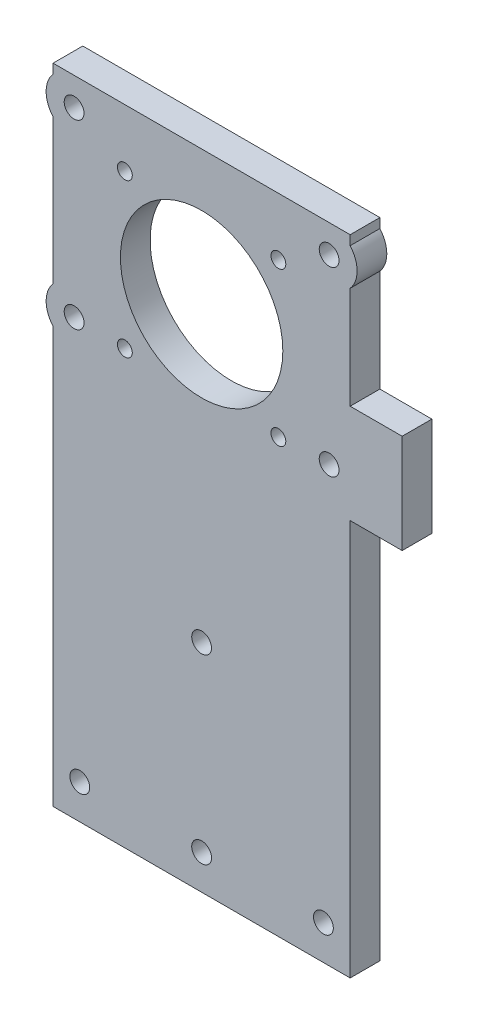
ISO-10303-21;
HEADER;
FILE_DESCRIPTION(('STEP AP214'),'2;1');
FILE_NAME('part.step','',(''),(''),'','','');
FILE_SCHEMA(('AUTOMOTIVE_DESIGN { 1 0 10303 214 1 1 1 1 }'));
ENDSEC;
DATA;
#1=APPLICATION_CONTEXT('core data for automotive mechanical design processes');
#2=APPLICATION_PROTOCOL_DEFINITION('international standard','automotive_design',2000,#1);
#3=PRODUCT_CONTEXT('',#1,'mechanical');
#4=PRODUCT('Part','Part','',(#3));
#5=PRODUCT_RELATED_PRODUCT_CATEGORY('part','',(#4));
#6=PRODUCT_DEFINITION_FORMATION('','',#4);
#7=PRODUCT_DEFINITION_CONTEXT('part definition',#1,'design');
#8=PRODUCT_DEFINITION('design','',#6,#7);
#9=PRODUCT_DEFINITION_SHAPE('','',#8);
#10=(LENGTH_UNIT() NAMED_UNIT(*) SI_UNIT(.MILLI.,.METRE.));
#11=(NAMED_UNIT(*) PLANE_ANGLE_UNIT() SI_UNIT($,.RADIAN.));
#12=(NAMED_UNIT(*) SI_UNIT($,.STERADIAN.) SOLID_ANGLE_UNIT());
#13=UNCERTAINTY_MEASURE_WITH_UNIT(LENGTH_MEASURE(1.E-05),#10,'distance_accuracy_value','');
#14=(GEOMETRIC_REPRESENTATION_CONTEXT(3) GLOBAL_UNCERTAINTY_ASSIGNED_CONTEXT((#13)) GLOBAL_UNIT_ASSIGNED_CONTEXT((#10,
#11,#12)) REPRESENTATION_CONTEXT('',''));
#15=CARTESIAN_POINT('',(0.,0.,0.));
#16=DIRECTION('',(0.,0.,1.));
#17=DIRECTION('',(1.,0.,0.));
#18=AXIS2_PLACEMENT_3D('',#15,#16,#17);
#19=CARTESIAN_POINT('',(30.,-62.,6.));
#20=DIRECTION('',(-1.,0.,0.));
#21=DIRECTION('',(0.,0.,1.));
#22=AXIS2_PLACEMENT_3D('',#19,#20,#21);
#23=PLANE('',#22);
#24=DIRECTION('',(0.,1.,0.));
#25=VECTOR('',#24,1.);
#26=CARTESIAN_POINT('',(30.,-62.,0.));
#27=LINE('',#26,#25);
#28=CARTESIAN_POINT('',(30.,-62.,0.));
#29=VERTEX_POINT('',#28);
#30=CARTESIAN_POINT('',(30.,18.,0.));
#31=VERTEX_POINT('',#30);
#32=EDGE_CURVE('E313',#29,#31,#27,.T.);
#33=ORIENTED_EDGE('',*,*,#32,.T.);
#34=DIRECTION('',(0.,0.,-1.));
#35=VECTOR('',#34,1.);
#36=CARTESIAN_POINT('',(30.,18.,28.588713996153));
#37=LINE('',#36,#35);
#38=CARTESIAN_POINT('',(30.,18.,6.));
#39=VERTEX_POINT('',#38);
#40=EDGE_CURVE('E56',#39,#31,#37,.T.);
#41=ORIENTED_EDGE('',*,*,#40,.F.);
#42=DIRECTION('',(0.,1.,0.));
#43=VECTOR('',#42,1.);
#44=CARTESIAN_POINT('',(30.,-62.,6.));
#45=LINE('',#44,#43);
#46=CARTESIAN_POINT('',(30.,-62.,6.));
#47=VERTEX_POINT('',#46);
#48=EDGE_CURVE('E304',#47,#39,#45,.T.);
#49=ORIENTED_EDGE('',*,*,#48,.F.);
#50=DIRECTION('',(0.,0.,-1.));
#51=VECTOR('',#50,1.);
#52=CARTESIAN_POINT('',(30.,-62.,6.));
#53=LINE('',#52,#51);
#54=EDGE_CURVE('E41',#47,#29,#53,.T.);
#55=ORIENTED_EDGE('',*,*,#54,.T.);
#56=EDGE_LOOP('',(#33,#41,#49,#55));
#57=FACE_BOUND('',#56,.T.);
#58=ADVANCED_FACE('F33',(#57),#23,.F.);
#59=CARTESIAN_POINT('',(-30.,-62.,6.));
#60=DIRECTION('',(1.,0.,0.));
#61=DIRECTION('',(0.,0.,-1.));
#62=AXIS2_PLACEMENT_3D('',#59,#60,#61);
#63=PLANE('',#62);
#64=DIRECTION('',(0.,-1.,0.));
#65=VECTOR('',#64,1.);
#66=CARTESIAN_POINT('',(-30.,-62.,6.));
#67=LINE('',#66,#65);
#68=CARTESIAN_POINT('',(-30.,21.9770979062027,6.));
#69=VERTEX_POINT('',#68);
#70=CARTESIAN_POINT('',(-30.,-62.,6.));
#71=VERTEX_POINT('',#70);
#72=EDGE_CURVE('E301',#69,#71,#67,.T.);
#73=ORIENTED_EDGE('',*,*,#72,.F.);
#74=DIRECTION('',(0.,0.,-1.));
#75=VECTOR('',#74,1.);
#76=CARTESIAN_POINT('',(-30.,21.9770979062027,28.588713996153));
#77=LINE('',#76,#75);
#78=CARTESIAN_POINT('',(-30.,21.9770979062027,0.));
#79=VERTEX_POINT('',#78);
#80=EDGE_CURVE('E183',#69,#79,#77,.T.);
#81=ORIENTED_EDGE('',*,*,#80,.T.);
#82=DIRECTION('',(0.,-1.,0.));
#83=VECTOR('',#82,1.);
#84=CARTESIAN_POINT('',(-30.,-62.,0.));
#85=LINE('',#84,#83);
#86=CARTESIAN_POINT('',(-30.,-62.,0.));
#87=VERTEX_POINT('',#86);
#88=EDGE_CURVE('E293',#79,#87,#85,.T.);
#89=ORIENTED_EDGE('',*,*,#88,.T.);
#90=DIRECTION('',(0.,0.,-1.));
#91=VECTOR('',#90,1.);
#92=CARTESIAN_POINT('',(-30.,-62.,6.));
#93=LINE('',#92,#91);
#94=EDGE_CURVE('E11',#71,#87,#93,.T.);
#95=ORIENTED_EDGE('',*,*,#94,.F.);
#96=EDGE_LOOP('',(#73,#81,#89,#95));
#97=FACE_BOUND('',#96,.T.);
#98=ADVANCED_FACE('F330',(#97),#63,.F.);
#99=CARTESIAN_POINT('',(-30.,58.6270979062027,0.));
#100=VERTEX_POINT('',#99);
#101=CARTESIAN_POINT('',(-30.,29.4229020937973,0.));
#102=VERTEX_POINT('',#101);
#103=EDGE_CURVE('E310',#100,#102,#85,.T.);
#104=ORIENTED_EDGE('',*,*,#103,.T.);
#105=DIRECTION('',(0.,0.,-1.));
#106=VECTOR('',#105,1.);
#107=CARTESIAN_POINT('',(-30.,29.4229020937973,28.588713996153));
#108=LINE('',#107,#106);
#109=CARTESIAN_POINT('',(-30.,29.4229020937973,6.));
#110=VERTEX_POINT('',#109);
#111=EDGE_CURVE('E179',#102,#110,#108,.F.);
#112=ORIENTED_EDGE('',*,*,#111,.T.);
#113=CARTESIAN_POINT('',(-30.,58.6270979062027,6.));
#114=VERTEX_POINT('',#113);
#115=EDGE_CURVE('E300',#114,#110,#67,.T.);
#116=ORIENTED_EDGE('',*,*,#115,.F.);
#117=DIRECTION('',(0.,0.,-1.));
#118=VECTOR('',#117,1.);
#119=CARTESIAN_POINT('',(-30.,58.6270979062027,28.588713996153));
#120=LINE('',#119,#118);
#121=EDGE_CURVE('E194',#114,#100,#120,.T.);
#122=ORIENTED_EDGE('',*,*,#121,.T.);
#123=EDGE_LOOP('',(#104,#112,#116,#122));
#124=FACE_BOUND('',#123,.T.);
#125=ADVANCED_FACE('F335',(#124),#63,.F.);
#126=CARTESIAN_POINT('',(30.,66.0729020937973,6.));
#127=VERTEX_POINT('',#126);
#128=CARTESIAN_POINT('',(30.,68.,6.));
#129=VERTEX_POINT('',#128);
#130=EDGE_CURVE('E303',#127,#129,#45,.T.);
#131=ORIENTED_EDGE('',*,*,#130,.F.);
#132=DIRECTION('',(0.,0.,-1.));
#133=VECTOR('',#132,1.);
#134=CARTESIAN_POINT('',(30.,66.0729020937973,28.588713996153));
#135=LINE('',#134,#133);
#136=CARTESIAN_POINT('',(30.,66.0729020937973,0.));
#137=VERTEX_POINT('',#136);
#138=EDGE_CURVE('E204',#127,#137,#135,.T.);
#139=ORIENTED_EDGE('',*,*,#138,.T.);
#140=CARTESIAN_POINT('',(30.,68.,0.));
#141=VERTEX_POINT('',#140);
#142=EDGE_CURVE('E312',#137,#141,#27,.T.);
#143=ORIENTED_EDGE('',*,*,#142,.T.);
#144=DIRECTION('',(0.,0.,-1.));
#145=VECTOR('',#144,1.);
#146=CARTESIAN_POINT('',(30.,68.,6.));
#147=LINE('',#146,#145);
#148=EDGE_CURVE('E235',#129,#141,#147,.T.);
#149=ORIENTED_EDGE('',*,*,#148,.F.);
#150=EDGE_LOOP('',(#131,#139,#143,#149));
#151=FACE_BOUND('',#150,.T.);
#152=ADVANCED_FACE('F354',(#151),#23,.F.);
#153=CARTESIAN_POINT('',(-30.,68.,0.));
#154=VERTEX_POINT('',#153);
#155=CARTESIAN_POINT('',(-30.,66.0729020937973,0.));
#156=VERTEX_POINT('',#155);
#157=EDGE_CURVE('E306',#154,#156,#85,.T.);
#158=ORIENTED_EDGE('',*,*,#157,.T.);
#159=DIRECTION('',(0.,0.,-1.));
#160=VECTOR('',#159,1.);
#161=CARTESIAN_POINT('',(-30.,66.0729020937973,28.588713996153));
#162=LINE('',#161,#160);
#163=CARTESIAN_POINT('',(-30.,66.0729020937973,6.));
#164=VERTEX_POINT('',#163);
#165=EDGE_CURVE('E190',#156,#164,#162,.F.);
#166=ORIENTED_EDGE('',*,*,#165,.T.);
#167=CARTESIAN_POINT('',(-30.,68.,6.));
#168=VERTEX_POINT('',#167);
#169=EDGE_CURVE('E296',#168,#164,#67,.T.);
#170=ORIENTED_EDGE('',*,*,#169,.F.);
#171=DIRECTION('',(0.,0.,1.));
#172=VECTOR('',#171,1.);
#173=CARTESIAN_POINT('',(-30.,68.,6.));
#174=LINE('',#173,#172);
#175=EDGE_CURVE('E242',#154,#168,#174,.T.);
#176=ORIENTED_EDGE('',*,*,#175,.F.);
#177=EDGE_LOOP('',(#158,#166,#170,#176));
#178=FACE_BOUND('',#177,.T.);
#179=ADVANCED_FACE('F35',(#178),#63,.F.);
#180=CARTESIAN_POINT('',(30.,-62.,6.));
#181=DIRECTION('',(0.,1.,0.));
#182=DIRECTION('',(-1.,0.,0.));
#183=AXIS2_PLACEMENT_3D('',#180,#181,#182);
#184=PLANE('',#183);
#185=DIRECTION('',(1.,0.,0.));
#186=VECTOR('',#185,1.);
#187=CARTESIAN_POINT('',(30.,-62.,0.));
#188=LINE('',#187,#186);
#189=EDGE_CURVE('E309',#87,#29,#188,.T.);
#190=ORIENTED_EDGE('',*,*,#189,.T.);
#191=ORIENTED_EDGE('',*,*,#54,.F.);
#192=DIRECTION('',(1.,0.,0.));
#193=VECTOR('',#192,1.);
#194=CARTESIAN_POINT('',(30.,-62.,6.));
#195=LINE('',#194,#193);
#196=EDGE_CURVE('E299',#71,#47,#195,.T.);
#197=ORIENTED_EDGE('',*,*,#196,.F.);
#198=ORIENTED_EDGE('',*,*,#94,.T.);
#199=EDGE_LOOP('',(#190,#191,#197,#198));
#200=FACE_BOUND('',#199,.T.);
#201=ADVANCED_FACE('F328',(#200),#184,.F.);
#202=CARTESIAN_POINT('',(30.,38.,6.));
#203=VERTEX_POINT('',#202);
#204=CARTESIAN_POINT('',(30.,58.6270979062027,6.));
#205=VERTEX_POINT('',#204);
#206=EDGE_CURVE('E48',#203,#205,#45,.T.);
#207=ORIENTED_EDGE('',*,*,#206,.F.);
#208=DIRECTION('',(0.,0.,-1.));
#209=VECTOR('',#208,1.);
#210=CARTESIAN_POINT('',(30.,38.,28.588713996153));
#211=LINE('',#210,#209);
#212=CARTESIAN_POINT('',(30.,38.,0.));
#213=VERTEX_POINT('',#212);
#214=EDGE_CURVE('E170',#203,#213,#211,.T.);
#215=ORIENTED_EDGE('',*,*,#214,.T.);
#216=CARTESIAN_POINT('',(30.,58.6270979062027,0.));
#217=VERTEX_POINT('',#216);
#218=EDGE_CURVE('E162',#213,#217,#27,.T.);
#219=ORIENTED_EDGE('',*,*,#218,.T.);
#220=DIRECTION('',(0.,0.,-1.));
#221=VECTOR('',#220,1.);
#222=CARTESIAN_POINT('',(30.,58.6270979062027,28.588713996153));
#223=LINE('',#222,#221);
#224=EDGE_CURVE('E200',#217,#205,#223,.F.);
#225=ORIENTED_EDGE('',*,*,#224,.T.);
#226=EDGE_LOOP('',(#207,#215,#219,#225));
#227=FACE_BOUND('',#226,.T.);
#228=ADVANCED_FACE('F357',(#227),#23,.F.);
#229=CARTESIAN_POINT('',(0.,0.,6.));
#230=DIRECTION('',(0.,0.,1.));
#231=DIRECTION('',(1.,0.,0.));
#232=AXIS2_PLACEMENT_3D('',#229,#230,#231);
#233=PLANE('',#232);
#234=ORIENTED_EDGE('',*,*,#115,.T.);
#235=CARTESIAN_POINT('',(-25.75,25.7,6.));
#236=DIRECTION('',(0.,0.,1.));
#237=DIRECTION('',(1.,0.,0.));
#238=AXIS2_PLACEMENT_3D('',#235,#236,#237);
#239=CIRCLE('',#238,5.65000000000003);
#240=EDGE_CURVE('E175',#69,#110,#239,.F.);
#241=ORIENTED_EDGE('',*,*,#240,.F.);
#242=ORIENTED_EDGE('',*,*,#72,.T.);
#243=ORIENTED_EDGE('',*,*,#196,.T.);
#244=ORIENTED_EDGE('',*,*,#48,.T.);
#245=DIRECTION('',(-1.,0.,0.));
#246=VECTOR('',#245,1.);
#247=CARTESIAN_POINT('',(40.5,18.,6.));
#248=LINE('',#247,#246);
#249=CARTESIAN_POINT('',(40.5,18.,6.));
#250=VERTEX_POINT('',#249);
#251=EDGE_CURVE('E163',#250,#39,#248,.T.);
#252=ORIENTED_EDGE('',*,*,#251,.F.);
#253=DIRECTION('',(0.,-1.,0.));
#254=VECTOR('',#253,1.);
#255=CARTESIAN_POINT('',(40.5,38.,6.));
#256=LINE('',#255,#254);
#257=CARTESIAN_POINT('',(40.5,38.,6.));
#258=VERTEX_POINT('',#257);
#259=EDGE_CURVE('E146',#258,#250,#256,.T.);
#260=ORIENTED_EDGE('',*,*,#259,.F.);
#261=DIRECTION('',(1.,0.,0.));
#262=VECTOR('',#261,1.);
#263=CARTESIAN_POINT('',(40.5,38.,6.));
#264=LINE('',#263,#262);
#265=EDGE_CURVE('E143',#203,#258,#264,.T.);
#266=ORIENTED_EDGE('',*,*,#265,.F.);
#267=ORIENTED_EDGE('',*,*,#206,.T.);
#268=CARTESIAN_POINT('',(25.75,62.35,6.));
#269=DIRECTION('',(0.,0.,1.));
#270=DIRECTION('',(1.,0.,0.));
#271=AXIS2_PLACEMENT_3D('',#268,#269,#270);
#272=CIRCLE('',#271,5.65000000000003);
#273=EDGE_CURVE('E197',#127,#205,#272,.F.);
#274=ORIENTED_EDGE('',*,*,#273,.F.);
#275=ORIENTED_EDGE('',*,*,#130,.T.);
#276=DIRECTION('',(1.,0.,0.));
#277=VECTOR('',#276,1.);
#278=CARTESIAN_POINT('',(30.,68.,6.));
#279=LINE('',#278,#277);
#280=EDGE_CURVE('E245',#168,#129,#279,.T.);
#281=ORIENTED_EDGE('',*,*,#280,.F.);
#282=ORIENTED_EDGE('',*,*,#169,.T.);
#283=CARTESIAN_POINT('',(-25.75,62.35,6.));
#284=DIRECTION('',(0.,0.,1.));
#285=DIRECTION('',(1.,0.,0.));
#286=AXIS2_PLACEMENT_3D('',#283,#284,#285);
#287=CIRCLE('',#286,5.65000000000003);
#288=EDGE_CURVE('E186',#114,#164,#287,.F.);
#289=ORIENTED_EDGE('',*,*,#288,.F.);
#290=EDGE_LOOP('',(#234,#241,#242,#243,#244,#252,#260,#266,#267,#274,#275,#281,#282,#289));
#291=FACE_BOUND('',#290,.T.);
#292=CARTESIAN_POINT('',(0.,-18.3,6.));
#293=DIRECTION('',(0.,0.,-1.));
#294=DIRECTION('',(-1.,0.,0.));
#295=AXIS2_PLACEMENT_3D('',#292,#293,#294);
#296=CIRCLE('',#295,2.);
#297=CARTESIAN_POINT('',(-2.00000000000001,-18.3,6.));
#298=VERTEX_POINT('',#297);
#299=EDGE_CURVE('E208',#298,#298,#296,.T.);
#300=ORIENTED_EDGE('',*,*,#299,.T.);
#301=EDGE_LOOP('',(#300));
#302=FACE_BOUND('',#301,.T.);
#303=CARTESIAN_POINT('',(25.75,25.7,6.));
#304=DIRECTION('',(0.,0.,-1.));
#305=DIRECTION('',(-1.,0.,0.));
#306=AXIS2_PLACEMENT_3D('',#303,#304,#305);
#307=CIRCLE('',#306,2.);
#308=CARTESIAN_POINT('',(23.75,25.7,6.));
#309=VERTEX_POINT('',#308);
#310=EDGE_CURVE('E214',#309,#309,#307,.T.);
#311=ORIENTED_EDGE('',*,*,#310,.T.);
#312=EDGE_LOOP('',(#311));
#313=FACE_BOUND('',#312,.T.);
#314=CARTESIAN_POINT('',(24.6,-55.,6.));
#315=DIRECTION('',(0.,0.,1.));
#316=DIRECTION('',(1.,0.,0.));
#317=AXIS2_PLACEMENT_3D('',#314,#315,#316);
#318=CIRCLE('',#317,2.);
#319=CARTESIAN_POINT('',(26.6,-55.,6.));
#320=VERTEX_POINT('',#319);
#321=EDGE_CURVE('E247',#320,#320,#318,.T.);
#322=ORIENTED_EDGE('',*,*,#321,.F.);
#323=EDGE_LOOP('',(#322));
#324=FACE_BOUND('',#323,.T.);
#325=CARTESIAN_POINT('',(0.,-55.,6.));
#326=DIRECTION('',(0.,0.,1.));
#327=DIRECTION('',(1.,0.,0.));
#328=AXIS2_PLACEMENT_3D('',#325,#326,#327);
#329=CIRCLE('',#328,2.);
#330=CARTESIAN_POINT('',(1.99999999999999,-55.,6.));
#331=VERTEX_POINT('',#330);
#332=EDGE_CURVE('E251',#331,#331,#329,.T.);
#333=ORIENTED_EDGE('',*,*,#332,.F.);
#334=EDGE_LOOP('',(#333));
#335=FACE_BOUND('',#334,.T.);
#336=CARTESIAN_POINT('',(-24.6,-55.,6.));
#337=DIRECTION('',(0.,0.,1.));
#338=DIRECTION('',(1.,0.,0.));
#339=AXIS2_PLACEMENT_3D('',#336,#337,#338);
#340=CIRCLE('',#339,2.);
#341=CARTESIAN_POINT('',(-22.6,-55.,6.));
#342=VERTEX_POINT('',#341);
#343=EDGE_CURVE('E257',#342,#342,#340,.T.);
#344=ORIENTED_EDGE('',*,*,#343,.F.);
#345=EDGE_LOOP('',(#344));
#346=FACE_BOUND('',#345,.T.);
#347=CARTESIAN_POINT('',(-15.5,25.35,6.));
#348=DIRECTION('',(0.,0.,1.));
#349=DIRECTION('',(1.,0.,0.));
#350=AXIS2_PLACEMENT_3D('',#347,#348,#349);
#351=CIRCLE('',#350,1.5);
#352=CARTESIAN_POINT('',(-14.,25.35,6.));
#353=VERTEX_POINT('',#352);
#354=EDGE_CURVE('E263',#353,#353,#351,.T.);
#355=ORIENTED_EDGE('',*,*,#354,.F.);
#356=EDGE_LOOP('',(#355));
#357=FACE_BOUND('',#356,.T.);
#358=CARTESIAN_POINT('',(15.5,25.35,6.));
#359=DIRECTION('',(0.,0.,1.));
#360=DIRECTION('',(1.,0.,0.));
#361=AXIS2_PLACEMENT_3D('',#358,#359,#360);
#362=CIRCLE('',#361,1.5);
#363=CARTESIAN_POINT('',(17.,25.35,6.));
#364=VERTEX_POINT('',#363);
#365=EDGE_CURVE('E269',#364,#364,#362,.T.);
#366=ORIENTED_EDGE('',*,*,#365,.F.);
#367=EDGE_LOOP('',(#366));
#368=FACE_BOUND('',#367,.T.);
#369=CARTESIAN_POINT('',(15.5,56.35,6.));
#370=DIRECTION('',(0.,0.,1.));
#371=DIRECTION('',(1.,0.,0.));
#372=AXIS2_PLACEMENT_3D('',#369,#370,#371);
#373=CIRCLE('',#372,1.5);
#374=CARTESIAN_POINT('',(17.,56.35,6.));
#375=VERTEX_POINT('',#374);
#376=EDGE_CURVE('E275',#375,#375,#373,.T.);
#377=ORIENTED_EDGE('',*,*,#376,.F.);
#378=EDGE_LOOP('',(#377));
#379=FACE_BOUND('',#378,.T.);
#380=CARTESIAN_POINT('',(-15.5,56.35,6.));
#381=DIRECTION('',(0.,0.,1.));
#382=DIRECTION('',(1.,0.,0.));
#383=AXIS2_PLACEMENT_3D('',#380,#381,#382);
#384=CIRCLE('',#383,1.5);
#385=CARTESIAN_POINT('',(-14.,56.35,6.));
#386=VERTEX_POINT('',#385);
#387=EDGE_CURVE('E281',#386,#386,#384,.T.);
#388=ORIENTED_EDGE('',*,*,#387,.F.);
#389=EDGE_LOOP('',(#388));
#390=FACE_BOUND('',#389,.T.);
#391=CARTESIAN_POINT('',(0.,40.85,6.));
#392=DIRECTION('',(0.,0.,1.));
#393=DIRECTION('',(1.,0.,0.));
#394=AXIS2_PLACEMENT_3D('',#391,#392,#393);
#395=CIRCLE('',#394,16.4);
#396=CARTESIAN_POINT('',(16.4,40.85,6.));
#397=VERTEX_POINT('',#396);
#398=EDGE_CURVE('E287',#397,#397,#395,.T.);
#399=ORIENTED_EDGE('',*,*,#398,.F.);
#400=EDGE_LOOP('',(#399));
#401=FACE_BOUND('',#400,.T.);
#402=CARTESIAN_POINT('',(25.75,62.35,6.));
#403=DIRECTION('',(0.,0.,-1.));
#404=DIRECTION('',(-1.,0.,0.));
#405=AXIS2_PLACEMENT_3D('',#402,#403,#404);
#406=CIRCLE('',#405,2.);
#407=CARTESIAN_POINT('',(23.75,62.35,6.));
#408=VERTEX_POINT('',#407);
#409=EDGE_CURVE('E232',#408,#408,#406,.T.);
#410=ORIENTED_EDGE('',*,*,#409,.T.);
#411=EDGE_LOOP('',(#410));
#412=FACE_BOUND('',#411,.T.);
#413=CARTESIAN_POINT('',(-25.75,62.35,6.));
#414=DIRECTION('',(0.,0.,-1.));
#415=DIRECTION('',(-1.,0.,0.));
#416=AXIS2_PLACEMENT_3D('',#413,#414,#415);
#417=CIRCLE('',#416,1.99999999999999);
#418=CARTESIAN_POINT('',(-27.75,62.35,6.));
#419=VERTEX_POINT('',#418);
#420=EDGE_CURVE('E226',#419,#419,#417,.T.);
#421=ORIENTED_EDGE('',*,*,#420,.T.);
#422=EDGE_LOOP('',(#421));
#423=FACE_BOUND('',#422,.T.);
#424=CARTESIAN_POINT('',(-25.75,25.7,6.));
#425=DIRECTION('',(0.,0.,-1.));
#426=DIRECTION('',(-1.,0.,0.));
#427=AXIS2_PLACEMENT_3D('',#424,#425,#426);
#428=CIRCLE('',#427,2.);
#429=CARTESIAN_POINT('',(-27.75,25.7,6.));
#430=VERTEX_POINT('',#429);
#431=EDGE_CURVE('E220',#430,#430,#428,.T.);
#432=ORIENTED_EDGE('',*,*,#431,.T.);
#433=EDGE_LOOP('',(#432));
#434=FACE_BOUND('',#433,.T.);
#435=ADVANCED_FACE('F324',(#291,#302,#313,#324,#335,#346,#357,#368,#379,#390,#401,#412,#423,
#434),#233,.T.);
#436=CARTESIAN_POINT('',(0.,0.,0.));
#437=DIRECTION('',(0.,0.,1.));
#438=DIRECTION('',(1.,0.,0.));
#439=AXIS2_PLACEMENT_3D('',#436,#437,#438);
#440=PLANE('',#439);
#441=CARTESIAN_POINT('',(0.,-18.3,0.));
#442=DIRECTION('',(0.,0.,-1.));
#443=DIRECTION('',(-1.,0.,0.));
#444=AXIS2_PLACEMENT_3D('',#441,#442,#443);
#445=CIRCLE('',#444,2.);
#446=CARTESIAN_POINT('',(-2.00000000000001,-18.3,0.));
#447=VERTEX_POINT('',#446);
#448=EDGE_CURVE('E207',#447,#447,#445,.T.);
#449=ORIENTED_EDGE('',*,*,#448,.F.);
#450=EDGE_LOOP('',(#449));
#451=FACE_BOUND('',#450,.T.);
#452=CARTESIAN_POINT('',(25.75,25.7,0.));
#453=DIRECTION('',(0.,0.,-1.));
#454=DIRECTION('',(-1.,0.,0.));
#455=AXIS2_PLACEMENT_3D('',#452,#453,#454);
#456=CIRCLE('',#455,2.);
#457=CARTESIAN_POINT('',(23.75,25.7,0.));
#458=VERTEX_POINT('',#457);
#459=EDGE_CURVE('E211',#458,#458,#456,.T.);
#460=ORIENTED_EDGE('',*,*,#459,.F.);
#461=EDGE_LOOP('',(#460));
#462=FACE_BOUND('',#461,.T.);
#463=CARTESIAN_POINT('',(24.6,-55.,0.));
#464=DIRECTION('',(0.,0.,1.));
#465=DIRECTION('',(1.,0.,0.));
#466=AXIS2_PLACEMENT_3D('',#463,#464,#465);
#467=CIRCLE('',#466,2.);
#468=CARTESIAN_POINT('',(26.6,-55.,0.));
#469=VERTEX_POINT('',#468);
#470=EDGE_CURVE('E248',#469,#469,#467,.T.);
#471=ORIENTED_EDGE('',*,*,#470,.T.);
#472=EDGE_LOOP('',(#471));
#473=FACE_BOUND('',#472,.T.);
#474=CARTESIAN_POINT('',(0.,-55.,0.));
#475=DIRECTION('',(0.,0.,1.));
#476=DIRECTION('',(1.,0.,0.));
#477=AXIS2_PLACEMENT_3D('',#474,#475,#476);
#478=CIRCLE('',#477,2.);
#479=CARTESIAN_POINT('',(1.99999999999999,-55.,0.));
#480=VERTEX_POINT('',#479);
#481=EDGE_CURVE('E254',#480,#480,#478,.T.);
#482=ORIENTED_EDGE('',*,*,#481,.T.);
#483=EDGE_LOOP('',(#482));
#484=FACE_BOUND('',#483,.T.);
#485=CARTESIAN_POINT('',(-24.6,-55.,0.));
#486=DIRECTION('',(0.,0.,1.));
#487=DIRECTION('',(1.,0.,0.));
#488=AXIS2_PLACEMENT_3D('',#485,#486,#487);
#489=CIRCLE('',#488,2.);
#490=CARTESIAN_POINT('',(-22.6,-55.,0.));
#491=VERTEX_POINT('',#490);
#492=EDGE_CURVE('E260',#491,#491,#489,.T.);
#493=ORIENTED_EDGE('',*,*,#492,.T.);
#494=EDGE_LOOP('',(#493));
#495=FACE_BOUND('',#494,.T.);
#496=CARTESIAN_POINT('',(-15.5,25.35,0.));
#497=DIRECTION('',(0.,0.,1.));
#498=DIRECTION('',(1.,0.,0.));
#499=AXIS2_PLACEMENT_3D('',#496,#497,#498);
#500=CIRCLE('',#499,1.5);
#501=CARTESIAN_POINT('',(-14.,25.35,0.));
#502=VERTEX_POINT('',#501);
#503=EDGE_CURVE('E266',#502,#502,#500,.T.);
#504=ORIENTED_EDGE('',*,*,#503,.T.);
#505=EDGE_LOOP('',(#504));
#506=FACE_BOUND('',#505,.T.);
#507=CARTESIAN_POINT('',(15.5,25.35,0.));
#508=DIRECTION('',(0.,0.,1.));
#509=DIRECTION('',(1.,0.,0.));
#510=AXIS2_PLACEMENT_3D('',#507,#508,#509);
#511=CIRCLE('',#510,1.5);
#512=CARTESIAN_POINT('',(17.,25.35,0.));
#513=VERTEX_POINT('',#512);
#514=EDGE_CURVE('E272',#513,#513,#511,.T.);
#515=ORIENTED_EDGE('',*,*,#514,.T.);
#516=EDGE_LOOP('',(#515));
#517=FACE_BOUND('',#516,.T.);
#518=CARTESIAN_POINT('',(15.5,56.35,0.));
#519=DIRECTION('',(0.,0.,1.));
#520=DIRECTION('',(1.,0.,0.));
#521=AXIS2_PLACEMENT_3D('',#518,#519,#520);
#522=CIRCLE('',#521,1.5);
#523=CARTESIAN_POINT('',(17.,56.35,0.));
#524=VERTEX_POINT('',#523);
#525=EDGE_CURVE('E278',#524,#524,#522,.T.);
#526=ORIENTED_EDGE('',*,*,#525,.T.);
#527=EDGE_LOOP('',(#526));
#528=FACE_BOUND('',#527,.T.);
#529=CARTESIAN_POINT('',(-15.5,56.35,0.));
#530=DIRECTION('',(0.,0.,1.));
#531=DIRECTION('',(1.,0.,0.));
#532=AXIS2_PLACEMENT_3D('',#529,#530,#531);
#533=CIRCLE('',#532,1.5);
#534=CARTESIAN_POINT('',(-14.,56.35,0.));
#535=VERTEX_POINT('',#534);
#536=EDGE_CURVE('E284',#535,#535,#533,.T.);
#537=ORIENTED_EDGE('',*,*,#536,.T.);
#538=EDGE_LOOP('',(#537));
#539=FACE_BOUND('',#538,.T.);
#540=CARTESIAN_POINT('',(0.,40.85,0.));
#541=DIRECTION('',(0.,0.,1.));
#542=DIRECTION('',(1.,0.,0.));
#543=AXIS2_PLACEMENT_3D('',#540,#541,#542);
#544=CIRCLE('',#543,16.4);
#545=CARTESIAN_POINT('',(16.4,40.85,0.));
#546=VERTEX_POINT('',#545);
#547=EDGE_CURVE('E290',#546,#546,#544,.T.);
#548=ORIENTED_EDGE('',*,*,#547,.T.);
#549=EDGE_LOOP('',(#548));
#550=FACE_BOUND('',#549,.T.);
#551=ORIENTED_EDGE('',*,*,#88,.F.);
#552=CARTESIAN_POINT('',(-25.75,25.7,0.));
#553=DIRECTION('',(0.,0.,-1.));
#554=DIRECTION('',(-1.,0.,0.));
#555=AXIS2_PLACEMENT_3D('',#552,#553,#554);
#556=CIRCLE('',#555,5.65000000000003);
#557=EDGE_CURVE('E176',#79,#102,#556,.T.);
#558=ORIENTED_EDGE('',*,*,#557,.T.);
#559=ORIENTED_EDGE('',*,*,#103,.F.);
#560=CARTESIAN_POINT('',(-25.75,62.35,0.));
#561=DIRECTION('',(0.,0.,-1.));
#562=DIRECTION('',(-1.,0.,0.));
#563=AXIS2_PLACEMENT_3D('',#560,#561,#562);
#564=CIRCLE('',#563,5.65000000000003);
#565=EDGE_CURVE('E187',#100,#156,#564,.T.);
#566=ORIENTED_EDGE('',*,*,#565,.T.);
#567=ORIENTED_EDGE('',*,*,#157,.F.);
#568=DIRECTION('',(-1.,0.,0.));
#569=VECTOR('',#568,1.);
#570=CARTESIAN_POINT('',(30.,68.,0.));
#571=LINE('',#570,#569);
#572=EDGE_CURVE('E240',#141,#154,#571,.T.);
#573=ORIENTED_EDGE('',*,*,#572,.F.);
#574=ORIENTED_EDGE('',*,*,#142,.F.);
#575=CARTESIAN_POINT('',(25.75,62.35,0.));
#576=DIRECTION('',(0.,0.,-1.));
#577=DIRECTION('',(-1.,0.,0.));
#578=AXIS2_PLACEMENT_3D('',#575,#576,#577);
#579=CIRCLE('',#578,5.65000000000003);
#580=EDGE_CURVE('E198',#137,#217,#579,.T.);
#581=ORIENTED_EDGE('',*,*,#580,.T.);
#582=ORIENTED_EDGE('',*,*,#218,.F.);
#583=DIRECTION('',(1.,0.,0.));
#584=VECTOR('',#583,1.);
#585=CARTESIAN_POINT('',(40.5,38.,0.));
#586=LINE('',#585,#584);
#587=CARTESIAN_POINT('',(40.5,38.,0.));
#588=VERTEX_POINT('',#587);
#589=EDGE_CURVE('E142',#213,#588,#586,.T.);
#590=ORIENTED_EDGE('',*,*,#589,.T.);
#591=DIRECTION('',(0.,-1.,0.));
#592=VECTOR('',#591,1.);
#593=CARTESIAN_POINT('',(40.5,38.,0.));
#594=LINE('',#593,#592);
#595=CARTESIAN_POINT('',(40.5,18.,0.));
#596=VERTEX_POINT('',#595);
#597=EDGE_CURVE('E149',#588,#596,#594,.T.);
#598=ORIENTED_EDGE('',*,*,#597,.T.);
#599=DIRECTION('',(-1.,0.,0.));
#600=VECTOR('',#599,1.);
#601=CARTESIAN_POINT('',(40.5,18.,0.));
#602=LINE('',#601,#600);
#603=EDGE_CURVE('E156',#596,#31,#602,.T.);
#604=ORIENTED_EDGE('',*,*,#603,.T.);
#605=ORIENTED_EDGE('',*,*,#32,.F.);
#606=ORIENTED_EDGE('',*,*,#189,.F.);
#607=EDGE_LOOP('',(#551,#558,#559,#566,#567,#573,#574,#581,#582,#590,#598,#604,#605,#606));
#608=FACE_BOUND('',#607,.T.);
#609=CARTESIAN_POINT('',(25.75,62.35,0.));
#610=DIRECTION('',(0.,0.,-1.));
#611=DIRECTION('',(-1.,0.,0.));
#612=AXIS2_PLACEMENT_3D('',#609,#610,#611);
#613=CIRCLE('',#612,2.);
#614=CARTESIAN_POINT('',(23.75,62.35,0.));
#615=VERTEX_POINT('',#614);
#616=EDGE_CURVE('E229',#615,#615,#613,.T.);
#617=ORIENTED_EDGE('',*,*,#616,.F.);
#618=EDGE_LOOP('',(#617));
#619=FACE_BOUND('',#618,.T.);
#620=CARTESIAN_POINT('',(-25.75,62.35,0.));
#621=DIRECTION('',(0.,0.,-1.));
#622=DIRECTION('',(-1.,0.,0.));
#623=AXIS2_PLACEMENT_3D('',#620,#621,#622);
#624=CIRCLE('',#623,1.99999999999999);
#625=CARTESIAN_POINT('',(-27.75,62.35,0.));
#626=VERTEX_POINT('',#625);
#627=EDGE_CURVE('E223',#626,#626,#624,.T.);
#628=ORIENTED_EDGE('',*,*,#627,.F.);
#629=EDGE_LOOP('',(#628));
#630=FACE_BOUND('',#629,.T.);
#631=CARTESIAN_POINT('',(-25.75,25.7,0.));
#632=DIRECTION('',(0.,0.,-1.));
#633=DIRECTION('',(-1.,0.,0.));
#634=AXIS2_PLACEMENT_3D('',#631,#632,#633);
#635=CIRCLE('',#634,2.);
#636=CARTESIAN_POINT('',(-27.75,25.7,0.));
#637=VERTEX_POINT('',#636);
#638=EDGE_CURVE('E217',#637,#637,#635,.T.);
#639=ORIENTED_EDGE('',*,*,#638,.F.);
#640=EDGE_LOOP('',(#639));
#641=FACE_BOUND('',#640,.T.);
#642=ADVANCED_FACE('F159',(#451,#462,#473,#484,#495,#506,#517,#528,#539,#550,#608,#619,#630,
#641),#440,.F.);
#643=CARTESIAN_POINT('',(0.,40.85,0.));
#644=DIRECTION('',(0.,0.,1.));
#645=DIRECTION('',(1.,0.,0.));
#646=AXIS2_PLACEMENT_3D('',#643,#644,#645);
#647=CYLINDRICAL_SURFACE('',#646,16.4);
#648=ORIENTED_EDGE('',*,*,#547,.F.);
#649=EDGE_LOOP('',(#648));
#650=FACE_BOUND('',#649,.T.);
#651=ORIENTED_EDGE('',*,*,#398,.T.);
#652=EDGE_LOOP('',(#651));
#653=FACE_BOUND('',#652,.T.);
#654=ADVANCED_FACE('F429',(#650,#653),#647,.F.);
#655=CARTESIAN_POINT('',(-15.5,56.35,0.));
#656=DIRECTION('',(0.,0.,1.));
#657=DIRECTION('',(1.,0.,0.));
#658=AXIS2_PLACEMENT_3D('',#655,#656,#657);
#659=CYLINDRICAL_SURFACE('',#658,1.5);
#660=ORIENTED_EDGE('',*,*,#536,.F.);
#661=EDGE_LOOP('',(#660));
#662=FACE_BOUND('',#661,.T.);
#663=ORIENTED_EDGE('',*,*,#387,.T.);
#664=EDGE_LOOP('',(#663));
#665=FACE_BOUND('',#664,.T.);
#666=ADVANCED_FACE('F576',(#662,#665),#659,.F.);
#667=CARTESIAN_POINT('',(15.5,56.35,0.));
#668=DIRECTION('',(0.,0.,1.));
#669=DIRECTION('',(1.,0.,0.));
#670=AXIS2_PLACEMENT_3D('',#667,#668,#669);
#671=CYLINDRICAL_SURFACE('',#670,1.5);
#672=ORIENTED_EDGE('',*,*,#525,.F.);
#673=EDGE_LOOP('',(#672));
#674=FACE_BOUND('',#673,.T.);
#675=ORIENTED_EDGE('',*,*,#376,.T.);
#676=EDGE_LOOP('',(#675));
#677=FACE_BOUND('',#676,.T.);
#678=ADVANCED_FACE('F585',(#674,#677),#671,.F.);
#679=CARTESIAN_POINT('',(15.5,25.35,0.));
#680=DIRECTION('',(0.,0.,1.));
#681=DIRECTION('',(1.,0.,0.));
#682=AXIS2_PLACEMENT_3D('',#679,#680,#681);
#683=CYLINDRICAL_SURFACE('',#682,1.5);
#684=ORIENTED_EDGE('',*,*,#514,.F.);
#685=EDGE_LOOP('',(#684));
#686=FACE_BOUND('',#685,.T.);
#687=ORIENTED_EDGE('',*,*,#365,.T.);
#688=EDGE_LOOP('',(#687));
#689=FACE_BOUND('',#688,.T.);
#690=ADVANCED_FACE('F594',(#686,#689),#683,.F.);
#691=CARTESIAN_POINT('',(-15.5,25.35,0.));
#692=DIRECTION('',(0.,0.,1.));
#693=DIRECTION('',(1.,0.,0.));
#694=AXIS2_PLACEMENT_3D('',#691,#692,#693);
#695=CYLINDRICAL_SURFACE('',#694,1.5);
#696=ORIENTED_EDGE('',*,*,#503,.F.);
#697=EDGE_LOOP('',(#696));
#698=FACE_BOUND('',#697,.T.);
#699=ORIENTED_EDGE('',*,*,#354,.T.);
#700=EDGE_LOOP('',(#699));
#701=FACE_BOUND('',#700,.T.);
#702=ADVANCED_FACE('F603',(#698,#701),#695,.F.);
#703=CARTESIAN_POINT('',(-24.6,-55.,0.));
#704=DIRECTION('',(0.,0.,1.));
#705=DIRECTION('',(1.,0.,0.));
#706=AXIS2_PLACEMENT_3D('',#703,#704,#705);
#707=CYLINDRICAL_SURFACE('',#706,2.);
#708=ORIENTED_EDGE('',*,*,#492,.F.);
#709=EDGE_LOOP('',(#708));
#710=FACE_BOUND('',#709,.T.);
#711=ORIENTED_EDGE('',*,*,#343,.T.);
#712=EDGE_LOOP('',(#711));
#713=FACE_BOUND('',#712,.T.);
#714=ADVANCED_FACE('F612',(#710,#713),#707,.F.);
#715=CARTESIAN_POINT('',(0.,-55.,0.));
#716=DIRECTION('',(0.,0.,1.));
#717=DIRECTION('',(1.,0.,0.));
#718=AXIS2_PLACEMENT_3D('',#715,#716,#717);
#719=CYLINDRICAL_SURFACE('',#718,2.);
#720=ORIENTED_EDGE('',*,*,#481,.F.);
#721=EDGE_LOOP('',(#720));
#722=FACE_BOUND('',#721,.T.);
#723=ORIENTED_EDGE('',*,*,#332,.T.);
#724=EDGE_LOOP('',(#723));
#725=FACE_BOUND('',#724,.T.);
#726=ADVANCED_FACE('F621',(#722,#725),#719,.F.);
#727=CARTESIAN_POINT('',(24.6,-55.,0.));
#728=DIRECTION('',(0.,0.,1.));
#729=DIRECTION('',(1.,0.,0.));
#730=AXIS2_PLACEMENT_3D('',#727,#728,#729);
#731=CYLINDRICAL_SURFACE('',#730,2.);
#732=ORIENTED_EDGE('',*,*,#470,.F.);
#733=EDGE_LOOP('',(#732));
#734=FACE_BOUND('',#733,.T.);
#735=ORIENTED_EDGE('',*,*,#321,.T.);
#736=EDGE_LOOP('',(#735));
#737=FACE_BOUND('',#736,.T.);
#738=ADVANCED_FACE('F441',(#734,#737),#731,.F.);
#739=CARTESIAN_POINT('',(0.,68.,0.));
#740=DIRECTION('',(0.,1.,0.));
#741=DIRECTION('',(0.,0.,1.));
#742=AXIS2_PLACEMENT_3D('',#739,#740,#741);
#743=PLANE('',#742);
#744=ORIENTED_EDGE('',*,*,#572,.T.);
#745=ORIENTED_EDGE('',*,*,#175,.T.);
#746=ORIENTED_EDGE('',*,*,#280,.T.);
#747=ORIENTED_EDGE('',*,*,#148,.T.);
#748=EDGE_LOOP('',(#744,#745,#746,#747));
#749=FACE_BOUND('',#748,.T.);
#750=ADVANCED_FACE('F350',(#749),#743,.T.);
#751=CARTESIAN_POINT('',(25.75,62.35,6.));
#752=DIRECTION('',(0.,0.,-1.));
#753=DIRECTION('',(-1.,0.,0.));
#754=AXIS2_PLACEMENT_3D('',#751,#752,#753);
#755=CYLINDRICAL_SURFACE('',#754,2.);
#756=ORIENTED_EDGE('',*,*,#409,.F.);
#757=EDGE_LOOP('',(#756));
#758=FACE_BOUND('',#757,.T.);
#759=ORIENTED_EDGE('',*,*,#616,.T.);
#760=EDGE_LOOP('',(#759));
#761=FACE_BOUND('',#760,.T.);
#762=ADVANCED_FACE('F440',(#758,#761),#755,.F.);
#763=CARTESIAN_POINT('',(-25.75,62.35,6.));
#764=DIRECTION('',(0.,0.,-1.));
#765=DIRECTION('',(-1.,0.,0.));
#766=AXIS2_PLACEMENT_3D('',#763,#764,#765);
#767=CYLINDRICAL_SURFACE('',#766,1.99999999999999);
#768=ORIENTED_EDGE('',*,*,#420,.F.);
#769=EDGE_LOOP('',(#768));
#770=FACE_BOUND('',#769,.T.);
#771=ORIENTED_EDGE('',*,*,#627,.T.);
#772=EDGE_LOOP('',(#771));
#773=FACE_BOUND('',#772,.T.);
#774=ADVANCED_FACE('F497',(#770,#773),#767,.F.);
#775=CARTESIAN_POINT('',(-25.75,25.7,6.));
#776=DIRECTION('',(0.,0.,-1.));
#777=DIRECTION('',(-1.,0.,0.));
#778=AXIS2_PLACEMENT_3D('',#775,#776,#777);
#779=CYLINDRICAL_SURFACE('',#778,2.);
#780=ORIENTED_EDGE('',*,*,#431,.F.);
#781=EDGE_LOOP('',(#780));
#782=FACE_BOUND('',#781,.T.);
#783=ORIENTED_EDGE('',*,*,#638,.T.);
#784=EDGE_LOOP('',(#783));
#785=FACE_BOUND('',#784,.T.);
#786=ADVANCED_FACE('F504',(#782,#785),#779,.F.);
#787=CARTESIAN_POINT('',(25.75,25.7,6.));
#788=DIRECTION('',(0.,0.,-1.));
#789=DIRECTION('',(-1.,0.,0.));
#790=AXIS2_PLACEMENT_3D('',#787,#788,#789);
#791=CYLINDRICAL_SURFACE('',#790,2.);
#792=ORIENTED_EDGE('',*,*,#310,.F.);
#793=EDGE_LOOP('',(#792));
#794=FACE_BOUND('',#793,.T.);
#795=ORIENTED_EDGE('',*,*,#459,.T.);
#796=EDGE_LOOP('',(#795));
#797=FACE_BOUND('',#796,.T.);
#798=ADVANCED_FACE('F368',(#794,#797),#791,.F.);
#799=CARTESIAN_POINT('',(0.,-18.3,6.));
#800=DIRECTION('',(0.,0.,-1.));
#801=DIRECTION('',(-1.,0.,0.));
#802=AXIS2_PLACEMENT_3D('',#799,#800,#801);
#803=CYLINDRICAL_SURFACE('',#802,2.);
#804=ORIENTED_EDGE('',*,*,#299,.F.);
#805=EDGE_LOOP('',(#804));
#806=FACE_BOUND('',#805,.T.);
#807=ORIENTED_EDGE('',*,*,#448,.T.);
#808=EDGE_LOOP('',(#807));
#809=FACE_BOUND('',#808,.T.);
#810=ADVANCED_FACE('F361',(#806,#809),#803,.F.);
#811=CARTESIAN_POINT('',(25.75,62.35,28.588713996153));
#812=DIRECTION('',(0.,0.,-1.));
#813=DIRECTION('',(-1.,0.,0.));
#814=AXIS2_PLACEMENT_3D('',#811,#812,#813);
#815=CYLINDRICAL_SURFACE('',#814,5.65000000000003);
#816=ORIENTED_EDGE('',*,*,#138,.F.);
#817=ORIENTED_EDGE('',*,*,#273,.T.);
#818=ORIENTED_EDGE('',*,*,#224,.F.);
#819=ORIENTED_EDGE('',*,*,#580,.F.);
#820=EDGE_LOOP('',(#816,#817,#818,#819));
#821=FACE_BOUND('',#820,.T.);
#822=ADVANCED_FACE('F359',(#821),#815,.T.);
#823=CARTESIAN_POINT('',(-25.75,62.35,28.588713996153));
#824=DIRECTION('',(0.,0.,-1.));
#825=DIRECTION('',(-1.,0.,0.));
#826=AXIS2_PLACEMENT_3D('',#823,#824,#825);
#827=CYLINDRICAL_SURFACE('',#826,5.65000000000003);
#828=ORIENTED_EDGE('',*,*,#121,.F.);
#829=ORIENTED_EDGE('',*,*,#288,.T.);
#830=ORIENTED_EDGE('',*,*,#165,.F.);
#831=ORIENTED_EDGE('',*,*,#565,.F.);
#832=EDGE_LOOP('',(#828,#829,#830,#831));
#833=FACE_BOUND('',#832,.T.);
#834=ADVANCED_FACE('F343',(#833),#827,.T.);
#835=CARTESIAN_POINT('',(-25.75,25.7,28.588713996153));
#836=DIRECTION('',(0.,0.,-1.));
#837=DIRECTION('',(-1.,0.,0.));
#838=AXIS2_PLACEMENT_3D('',#835,#836,#837);
#839=CYLINDRICAL_SURFACE('',#838,5.65000000000003);
#840=ORIENTED_EDGE('',*,*,#80,.F.);
#841=ORIENTED_EDGE('',*,*,#240,.T.);
#842=ORIENTED_EDGE('',*,*,#111,.F.);
#843=ORIENTED_EDGE('',*,*,#557,.F.);
#844=EDGE_LOOP('',(#840,#841,#842,#843));
#845=FACE_BOUND('',#844,.T.);
#846=ADVANCED_FACE('F340',(#845),#839,.T.);
#847=CARTESIAN_POINT('',(40.5,18.,28.588713996153));
#848=DIRECTION('',(0.,-1.,0.));
#849=DIRECTION('',(0.,0.,-1.));
#850=AXIS2_PLACEMENT_3D('',#847,#848,#849);
#851=PLANE('',#850);
#852=DIRECTION('',(0.,0.,-1.));
#853=VECTOR('',#852,1.);
#854=CARTESIAN_POINT('',(40.5,18.,28.588713996153));
#855=LINE('',#854,#853);
#856=EDGE_CURVE('E152',#250,#596,#855,.T.);
#857=ORIENTED_EDGE('',*,*,#856,.F.);
#858=ORIENTED_EDGE('',*,*,#251,.T.);
#859=ORIENTED_EDGE('',*,*,#40,.T.);
#860=ORIENTED_EDGE('',*,*,#603,.F.);
#861=EDGE_LOOP('',(#857,#858,#859,#860));
#862=FACE_BOUND('',#861,.T.);
#863=ADVANCED_FACE('F321',(#862),#851,.T.);
#864=CARTESIAN_POINT('',(40.5,38.,28.588713996153));
#865=DIRECTION('',(0.,1.,0.));
#866=DIRECTION('',(0.,0.,1.));
#867=AXIS2_PLACEMENT_3D('',#864,#865,#866);
#868=PLANE('',#867);
#869=ORIENTED_EDGE('',*,*,#214,.F.);
#870=ORIENTED_EDGE('',*,*,#265,.T.);
#871=DIRECTION('',(0.,0.,-1.));
#872=VECTOR('',#871,1.);
#873=CARTESIAN_POINT('',(40.5,38.,28.588713996153));
#874=LINE('',#873,#872);
#875=EDGE_CURVE('E137',#258,#588,#874,.T.);
#876=ORIENTED_EDGE('',*,*,#875,.T.);
#877=ORIENTED_EDGE('',*,*,#589,.F.);
#878=EDGE_LOOP('',(#869,#870,#876,#877));
#879=FACE_BOUND('',#878,.T.);
#880=ADVANCED_FACE('F140',(#879),#868,.T.);
#881=CARTESIAN_POINT('',(40.5,38.,28.588713996153));
#882=DIRECTION('',(1.,0.,0.));
#883=DIRECTION('',(0.,0.,-1.));
#884=AXIS2_PLACEMENT_3D('',#881,#882,#883);
#885=PLANE('',#884);
#886=ORIENTED_EDGE('',*,*,#875,.F.);
#887=ORIENTED_EDGE('',*,*,#259,.T.);
#888=ORIENTED_EDGE('',*,*,#856,.T.);
#889=ORIENTED_EDGE('',*,*,#597,.F.);
#890=EDGE_LOOP('',(#886,#887,#888,#889));
#891=FACE_BOUND('',#890,.T.);
#892=ADVANCED_FACE('F150',(#891),#885,.T.);
#893=CLOSED_SHELL('',(#58,#98,#125,#152,#179,#201,#228,#435,#642,#654,#666,#678,#690,#702,#714,
#726,#738,#750,#762,#774,#786,#798,#810,#822,#834,#846,#863,#880,#892));
#894=MANIFOLD_SOLID_BREP('B2',#893);
#895=ADVANCED_BREP_SHAPE_REPRESENTATION('',(#18,#894),#14);
#896=SHAPE_DEFINITION_REPRESENTATION(#9,#895);
ENDSEC;
END-ISO-10303-21;
